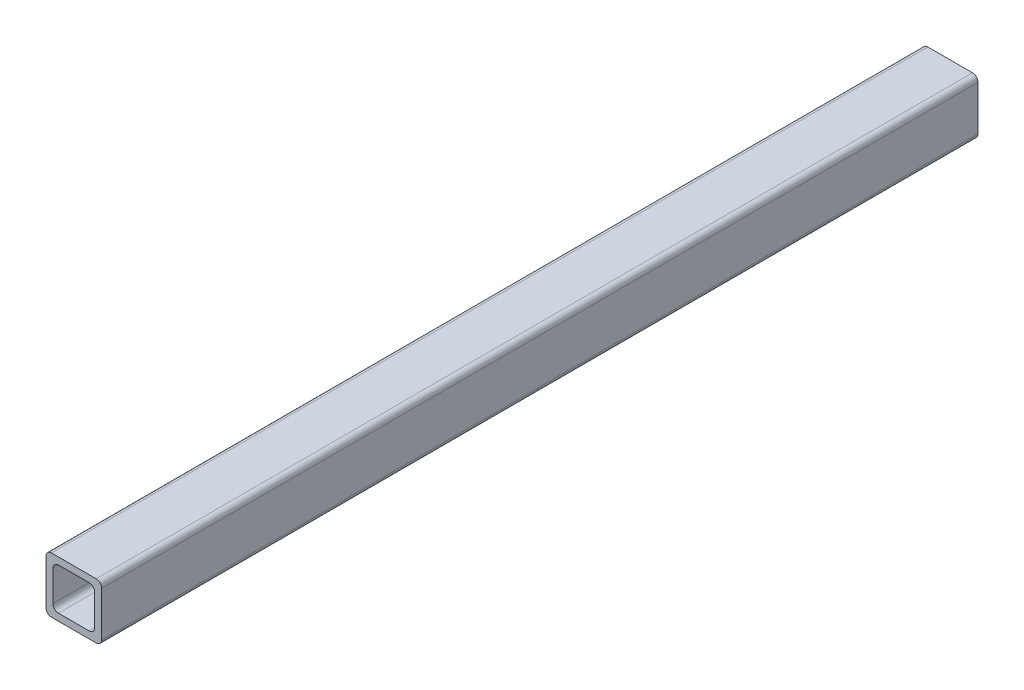
ISO-10303-21;
HEADER;
FILE_DESCRIPTION(('STEP AP214'),'2;1');
FILE_NAME('part.step','',(''),(''),'','','');
FILE_SCHEMA(('AUTOMOTIVE_DESIGN { 1 0 10303 214 1 1 1 1 }'));
ENDSEC;
DATA;
#1=APPLICATION_CONTEXT('core data for automotive mechanical design processes');
#2=APPLICATION_PROTOCOL_DEFINITION('international standard','automotive_design',2000,#1);
#3=PRODUCT_CONTEXT('',#1,'mechanical');
#4=PRODUCT('Part','Part','',(#3));
#5=PRODUCT_RELATED_PRODUCT_CATEGORY('part','',(#4));
#6=PRODUCT_DEFINITION_FORMATION('','',#4);
#7=PRODUCT_DEFINITION_CONTEXT('part definition',#1,'design');
#8=PRODUCT_DEFINITION('design','',#6,#7);
#9=PRODUCT_DEFINITION_SHAPE('','',#8);
#10=(LENGTH_UNIT() NAMED_UNIT(*) SI_UNIT(.MILLI.,.METRE.));
#11=(NAMED_UNIT(*) PLANE_ANGLE_UNIT() SI_UNIT($,.RADIAN.));
#12=(NAMED_UNIT(*) SI_UNIT($,.STERADIAN.) SOLID_ANGLE_UNIT());
#13=UNCERTAINTY_MEASURE_WITH_UNIT(LENGTH_MEASURE(1.E-05),#10,'distance_accuracy_value','');
#14=(GEOMETRIC_REPRESENTATION_CONTEXT(3) GLOBAL_UNCERTAINTY_ASSIGNED_CONTEXT((#13)) GLOBAL_UNIT_ASSIGNED_CONTEXT((#10,
#11,#12)) REPRESENTATION_CONTEXT('',''));
#15=CARTESIAN_POINT('',(0.,0.,0.));
#16=DIRECTION('',(0.,0.,1.));
#17=DIRECTION('',(1.,0.,0.));
#18=AXIS2_PLACEMENT_3D('',#15,#16,#17);
#19=CARTESIAN_POINT('',(10.2,-10.2,400.));
#20=DIRECTION('',(0.,0.,-1.));
#21=DIRECTION('',(-1.,0.,0.));
#22=AXIS2_PLACEMENT_3D('',#19,#20,#21);
#23=PLANE('',#22);
#24=CARTESIAN_POINT('',(10.2,-10.2,400.));
#25=DIRECTION('',(0.,0.,1.));
#26=DIRECTION('',(-1.,0.,0.));
#27=AXIS2_PLACEMENT_3D('',#24,#25,#26);
#28=CIRCLE('',#27,2.5);
#29=CARTESIAN_POINT('',(10.2,-12.7,400.));
#30=VERTEX_POINT('',#29);
#31=CARTESIAN_POINT('',(12.7,-10.2,400.));
#32=VERTEX_POINT('',#31);
#33=EDGE_CURVE('E242',#30,#32,#28,.T.);
#34=ORIENTED_EDGE('',*,*,#33,.T.);
#35=DIRECTION('',(0.,1.,0.));
#36=VECTOR('',#35,1.);
#37=CARTESIAN_POINT('',(12.7,-10.2,400.));
#38=LINE('',#37,#36);
#39=CARTESIAN_POINT('',(12.7,10.2,400.));
#40=VERTEX_POINT('',#39);
#41=EDGE_CURVE('E246',#32,#40,#38,.T.);
#42=ORIENTED_EDGE('',*,*,#41,.T.);
#43=CARTESIAN_POINT('',(10.2,10.2,400.));
#44=DIRECTION('',(0.,0.,1.));
#45=DIRECTION('',(1.,0.,0.));
#46=AXIS2_PLACEMENT_3D('',#43,#44,#45);
#47=CIRCLE('',#46,2.5);
#48=CARTESIAN_POINT('',(10.2,12.7,400.));
#49=VERTEX_POINT('',#48);
#50=EDGE_CURVE('E250',#40,#49,#47,.T.);
#51=ORIENTED_EDGE('',*,*,#50,.T.);
#52=DIRECTION('',(-1.,0.,0.));
#53=VECTOR('',#52,1.);
#54=CARTESIAN_POINT('',(-10.2,12.7,400.));
#55=LINE('',#54,#53);
#56=CARTESIAN_POINT('',(-10.2,12.7,400.));
#57=VERTEX_POINT('',#56);
#58=EDGE_CURVE('E253',#49,#57,#55,.T.);
#59=ORIENTED_EDGE('',*,*,#58,.T.);
#60=CARTESIAN_POINT('',(-10.2,10.2,400.));
#61=DIRECTION('',(0.,0.,1.));
#62=DIRECTION('',(1.,0.,0.));
#63=AXIS2_PLACEMENT_3D('',#60,#61,#62);
#64=CIRCLE('',#63,2.5);
#65=CARTESIAN_POINT('',(-12.7,10.2,400.));
#66=VERTEX_POINT('',#65);
#67=EDGE_CURVE('E256',#57,#66,#64,.T.);
#68=ORIENTED_EDGE('',*,*,#67,.T.);
#69=DIRECTION('',(0.,-1.,0.));
#70=VECTOR('',#69,1.);
#71=CARTESIAN_POINT('',(-12.7,-10.2,400.));
#72=LINE('',#71,#70);
#73=CARTESIAN_POINT('',(-12.7,-10.2,400.));
#74=VERTEX_POINT('',#73);
#75=EDGE_CURVE('E259',#66,#74,#72,.T.);
#76=ORIENTED_EDGE('',*,*,#75,.T.);
#77=CARTESIAN_POINT('',(-10.2,-10.2,400.));
#78=DIRECTION('',(0.,0.,1.));
#79=DIRECTION('',(-1.,0.,0.));
#80=AXIS2_PLACEMENT_3D('',#77,#78,#79);
#81=CIRCLE('',#80,2.5);
#82=CARTESIAN_POINT('',(-10.2,-12.7,400.));
#83=VERTEX_POINT('',#82);
#84=EDGE_CURVE('E262',#74,#83,#81,.T.);
#85=ORIENTED_EDGE('',*,*,#84,.T.);
#86=DIRECTION('',(1.,0.,0.));
#87=VECTOR('',#86,1.);
#88=CARTESIAN_POINT('',(-10.2,-12.7,400.));
#89=LINE('',#88,#87);
#90=EDGE_CURVE('E265',#83,#30,#89,.T.);
#91=ORIENTED_EDGE('',*,*,#90,.T.);
#92=EDGE_LOOP('',(#34,#42,#51,#59,#68,#76,#85,#91));
#93=FACE_BOUND('',#92,.T.);
#94=CARTESIAN_POINT('',(-7.02500000000001,-7.02499999999998,400.));
#95=DIRECTION('',(0.,0.,1.));
#96=DIRECTION('',(-1.,0.,0.));
#97=AXIS2_PLACEMENT_3D('',#94,#95,#96);
#98=CIRCLE('',#97,2.5);
#99=CARTESIAN_POINT('',(-9.52500000000001,-7.02499999999998,400.));
#100=VERTEX_POINT('',#99);
#101=CARTESIAN_POINT('',(-7.02500000000001,-9.52499999999998,400.));
#102=VERTEX_POINT('',#101);
#103=EDGE_CURVE('E153',#100,#102,#98,.T.);
#104=ORIENTED_EDGE('',*,*,#103,.F.);
#105=DIRECTION('',(0.,-1.,0.));
#106=VECTOR('',#105,1.);
#107=CARTESIAN_POINT('',(-9.52500000000001,-7.02499999999998,400.));
#108=LINE('',#107,#106);
#109=CARTESIAN_POINT('',(-9.52500000000001,7.025,400.));
#110=VERTEX_POINT('',#109);
#111=EDGE_CURVE('E194',#110,#100,#108,.T.);
#112=ORIENTED_EDGE('',*,*,#111,.F.);
#113=CARTESIAN_POINT('',(-7.025,7.025,400.));
#114=DIRECTION('',(0.,0.,1.));
#115=DIRECTION('',(-1.,0.,0.));
#116=AXIS2_PLACEMENT_3D('',#113,#114,#115);
#117=CIRCLE('',#116,2.5);
#118=CARTESIAN_POINT('',(-7.025,9.52500000000001,400.));
#119=VERTEX_POINT('',#118);
#120=EDGE_CURVE('E191',#119,#110,#117,.T.);
#121=ORIENTED_EDGE('',*,*,#120,.F.);
#122=DIRECTION('',(-1.,0.,0.));
#123=VECTOR('',#122,1.);
#124=CARTESIAN_POINT('',(-7.025,9.52500000000001,400.));
#125=LINE('',#124,#123);
#126=CARTESIAN_POINT('',(7.02499999999999,9.52500000000001,400.));
#127=VERTEX_POINT('',#126);
#128=EDGE_CURVE('E188',#127,#119,#125,.T.);
#129=ORIENTED_EDGE('',*,*,#128,.F.);
#130=CARTESIAN_POINT('',(7.02499999999999,7.025,400.));
#131=DIRECTION('',(0.,0.,1.));
#132=DIRECTION('',(1.,0.,0.));
#133=AXIS2_PLACEMENT_3D('',#130,#131,#132);
#134=CIRCLE('',#133,2.5);
#135=CARTESIAN_POINT('',(9.52499999999999,7.025,400.));
#136=VERTEX_POINT('',#135);
#137=EDGE_CURVE('E185',#136,#127,#134,.T.);
#138=ORIENTED_EDGE('',*,*,#137,.F.);
#139=DIRECTION('',(0.,1.,0.));
#140=VECTOR('',#139,1.);
#141=CARTESIAN_POINT('',(9.52499999999999,-7.02499999999998,400.));
#142=LINE('',#141,#140);
#143=CARTESIAN_POINT('',(9.52499999999999,-7.02499999999998,400.));
#144=VERTEX_POINT('',#143);
#145=EDGE_CURVE('E180',#144,#136,#142,.T.);
#146=ORIENTED_EDGE('',*,*,#145,.F.);
#147=CARTESIAN_POINT('',(7.02499999999999,-7.02499999999998,400.));
#148=DIRECTION('',(0.,0.,1.));
#149=DIRECTION('',(1.,0.,0.));
#150=AXIS2_PLACEMENT_3D('',#147,#148,#149);
#151=CIRCLE('',#150,2.5);
#152=CARTESIAN_POINT('',(7.02499999999999,-9.52499999999998,400.));
#153=VERTEX_POINT('',#152);
#154=EDGE_CURVE('E176',#153,#144,#151,.T.);
#155=ORIENTED_EDGE('',*,*,#154,.F.);
#156=DIRECTION('',(1.,0.,0.));
#157=VECTOR('',#156,1.);
#158=CARTESIAN_POINT('',(-7.02500000000001,-9.52499999999998,400.));
#159=LINE('',#158,#157);
#160=EDGE_CURVE('E162',#102,#153,#159,.T.);
#161=ORIENTED_EDGE('',*,*,#160,.F.);
#162=EDGE_LOOP('',(#104,#112,#121,#129,#138,#146,#155,#161));
#163=FACE_BOUND('',#162,.T.);
#164=ADVANCED_FACE('F39',(#93,#163),#23,.F.);
#165=CARTESIAN_POINT('',(10.2,-10.2,0.));
#166=DIRECTION('',(0.,0.,-1.));
#167=DIRECTION('',(-1.,0.,0.));
#168=AXIS2_PLACEMENT_3D('',#165,#166,#167);
#169=PLANE('',#168);
#170=CARTESIAN_POINT('',(10.2,-10.2,0.));
#171=DIRECTION('',(0.,0.,1.));
#172=DIRECTION('',(-1.,0.,0.));
#173=AXIS2_PLACEMENT_3D('',#170,#171,#172);
#174=CIRCLE('',#173,2.5);
#175=CARTESIAN_POINT('',(10.2,-12.7,0.));
#176=VERTEX_POINT('',#175);
#177=CARTESIAN_POINT('',(12.7,-10.2,0.));
#178=VERTEX_POINT('',#177);
#179=EDGE_CURVE('E171',#176,#178,#174,.T.);
#180=ORIENTED_EDGE('',*,*,#179,.F.);
#181=DIRECTION('',(1.,0.,0.));
#182=VECTOR('',#181,1.);
#183=CARTESIAN_POINT('',(-10.2,-12.7,0.));
#184=LINE('',#183,#182);
#185=CARTESIAN_POINT('',(-10.2,-12.7,0.));
#186=VERTEX_POINT('',#185);
#187=EDGE_CURVE('E247',#186,#176,#184,.T.);
#188=ORIENTED_EDGE('',*,*,#187,.F.);
#189=CARTESIAN_POINT('',(-10.2,-10.2,0.));
#190=DIRECTION('',(0.,0.,1.));
#191=DIRECTION('',(-1.,0.,0.));
#192=AXIS2_PLACEMENT_3D('',#189,#190,#191);
#193=CIRCLE('',#192,2.5);
#194=CARTESIAN_POINT('',(-12.7,-10.2,0.));
#195=VERTEX_POINT('',#194);
#196=EDGE_CURVE('E287',#195,#186,#193,.T.);
#197=ORIENTED_EDGE('',*,*,#196,.F.);
#198=DIRECTION('',(0.,-1.,0.));
#199=VECTOR('',#198,1.);
#200=CARTESIAN_POINT('',(-12.7,-10.2,0.));
#201=LINE('',#200,#199);
#202=CARTESIAN_POINT('',(-12.7,10.2,0.));
#203=VERTEX_POINT('',#202);
#204=EDGE_CURVE('E284',#203,#195,#201,.T.);
#205=ORIENTED_EDGE('',*,*,#204,.F.);
#206=CARTESIAN_POINT('',(-10.2,10.2,0.));
#207=DIRECTION('',(0.,0.,1.));
#208=DIRECTION('',(1.,0.,0.));
#209=AXIS2_PLACEMENT_3D('',#206,#207,#208);
#210=CIRCLE('',#209,2.5);
#211=CARTESIAN_POINT('',(-10.2,12.7,0.));
#212=VERTEX_POINT('',#211);
#213=EDGE_CURVE('E281',#212,#203,#210,.T.);
#214=ORIENTED_EDGE('',*,*,#213,.F.);
#215=DIRECTION('',(-1.,0.,0.));
#216=VECTOR('',#215,1.);
#217=CARTESIAN_POINT('',(-10.2,12.7,0.));
#218=LINE('',#217,#216);
#219=CARTESIAN_POINT('',(10.2,12.7,0.));
#220=VERTEX_POINT('',#219);
#221=EDGE_CURVE('E278',#220,#212,#218,.T.);
#222=ORIENTED_EDGE('',*,*,#221,.F.);
#223=CARTESIAN_POINT('',(10.2,10.2,0.));
#224=DIRECTION('',(0.,0.,1.));
#225=DIRECTION('',(1.,0.,0.));
#226=AXIS2_PLACEMENT_3D('',#223,#224,#225);
#227=CIRCLE('',#226,2.5);
#228=CARTESIAN_POINT('',(12.7,10.2,0.));
#229=VERTEX_POINT('',#228);
#230=EDGE_CURVE('E275',#229,#220,#227,.T.);
#231=ORIENTED_EDGE('',*,*,#230,.F.);
#232=DIRECTION('',(0.,1.,0.));
#233=VECTOR('',#232,1.);
#234=CARTESIAN_POINT('',(12.7,-10.2,0.));
#235=LINE('',#234,#233);
#236=EDGE_CURVE('E272',#178,#229,#235,.T.);
#237=ORIENTED_EDGE('',*,*,#236,.F.);
#238=EDGE_LOOP('',(#180,#188,#197,#205,#214,#222,#231,#237));
#239=FACE_BOUND('',#238,.T.);
#240=DIRECTION('',(0.,-1.,0.));
#241=VECTOR('',#240,1.);
#242=CARTESIAN_POINT('',(-9.52500000000001,-7.02499999999998,0.));
#243=LINE('',#242,#241);
#244=CARTESIAN_POINT('',(-9.52500000000001,7.02500000000001,0.));
#245=VERTEX_POINT('',#244);
#246=CARTESIAN_POINT('',(-9.52500000000001,-7.02499999999998,0.));
#247=VERTEX_POINT('',#246);
#248=EDGE_CURVE('E163',#245,#247,#243,.T.);
#249=ORIENTED_EDGE('',*,*,#248,.T.);
#250=CARTESIAN_POINT('',(-7.02500000000001,-7.02499999999998,0.));
#251=DIRECTION('',(0.,0.,1.));
#252=DIRECTION('',(-1.,0.,0.));
#253=AXIS2_PLACEMENT_3D('',#250,#251,#252);
#254=CIRCLE('',#253,2.5);
#255=CARTESIAN_POINT('',(-7.02500000000001,-9.52499999999998,0.));
#256=VERTEX_POINT('',#255);
#257=EDGE_CURVE('E63',#247,#256,#254,.T.);
#258=ORIENTED_EDGE('',*,*,#257,.T.);
#259=DIRECTION('',(1.,0.,0.));
#260=VECTOR('',#259,1.);
#261=CARTESIAN_POINT('',(-7.02500000000001,-9.52499999999998,0.));
#262=LINE('',#261,#260);
#263=CARTESIAN_POINT('',(7.02499999999999,-9.52499999999998,0.));
#264=VERTEX_POINT('',#263);
#265=EDGE_CURVE('E169',#256,#264,#262,.T.);
#266=ORIENTED_EDGE('',*,*,#265,.T.);
#267=CARTESIAN_POINT('',(7.02499999999999,-7.02499999999998,0.));
#268=DIRECTION('',(0.,0.,1.));
#269=DIRECTION('',(1.,0.,0.));
#270=AXIS2_PLACEMENT_3D('',#267,#268,#269);
#271=CIRCLE('',#270,2.5);
#272=CARTESIAN_POINT('',(9.52499999999999,-7.02499999999998,0.));
#273=VERTEX_POINT('',#272);
#274=EDGE_CURVE('E201',#264,#273,#271,.T.);
#275=ORIENTED_EDGE('',*,*,#274,.T.);
#276=DIRECTION('',(0.,1.,0.));
#277=VECTOR('',#276,1.);
#278=CARTESIAN_POINT('',(9.52499999999999,-7.02499999999998,0.));
#279=LINE('',#278,#277);
#280=CARTESIAN_POINT('',(9.52499999999999,7.025,0.));
#281=VERTEX_POINT('',#280);
#282=EDGE_CURVE('E205',#273,#281,#279,.T.);
#283=ORIENTED_EDGE('',*,*,#282,.T.);
#284=CARTESIAN_POINT('',(7.02499999999999,7.025,0.));
#285=DIRECTION('',(0.,0.,1.));
#286=DIRECTION('',(1.,0.,0.));
#287=AXIS2_PLACEMENT_3D('',#284,#285,#286);
#288=CIRCLE('',#287,2.5);
#289=CARTESIAN_POINT('',(7.02499999999999,9.52500000000001,0.));
#290=VERTEX_POINT('',#289);
#291=EDGE_CURVE('E209',#281,#290,#288,.T.);
#292=ORIENTED_EDGE('',*,*,#291,.T.);
#293=DIRECTION('',(-1.,0.,0.));
#294=VECTOR('',#293,1.);
#295=CARTESIAN_POINT('',(-7.025,9.52500000000001,0.));
#296=LINE('',#295,#294);
#297=CARTESIAN_POINT('',(-7.025,9.52500000000001,0.));
#298=VERTEX_POINT('',#297);
#299=EDGE_CURVE('E213',#290,#298,#296,.T.);
#300=ORIENTED_EDGE('',*,*,#299,.T.);
#301=CARTESIAN_POINT('',(-7.025,7.025,0.));
#302=DIRECTION('',(0.,0.,1.));
#303=DIRECTION('',(-1.,0.,0.));
#304=AXIS2_PLACEMENT_3D('',#301,#302,#303);
#305=CIRCLE('',#304,2.5);
#306=EDGE_CURVE('E217',#298,#245,#305,.T.);
#307=ORIENTED_EDGE('',*,*,#306,.T.);
#308=EDGE_LOOP('',(#249,#258,#266,#275,#283,#292,#300,#307));
#309=FACE_BOUND('',#308,.T.);
#310=ADVANCED_FACE('F326',(#239,#309),#169,.T.);
#311=CARTESIAN_POINT('',(10.2,-10.2,400.));
#312=DIRECTION('',(0.,0.,-1.));
#313=DIRECTION('',(-1.,0.,0.));
#314=AXIS2_PLACEMENT_3D('',#311,#312,#313);
#315=CYLINDRICAL_SURFACE('',#314,2.5);
#316=ORIENTED_EDGE('',*,*,#179,.T.);
#317=DIRECTION('',(0.,0.,-1.));
#318=VECTOR('',#317,1.);
#319=CARTESIAN_POINT('',(12.7,-10.2,400.));
#320=LINE('',#319,#318);
#321=EDGE_CURVE('E11',#32,#178,#320,.T.);
#322=ORIENTED_EDGE('',*,*,#321,.F.);
#323=ORIENTED_EDGE('',*,*,#33,.F.);
#324=DIRECTION('',(0.,0.,-1.));
#325=VECTOR('',#324,1.);
#326=CARTESIAN_POINT('',(10.2,-12.7,400.));
#327=LINE('',#326,#325);
#328=EDGE_CURVE('E268',#30,#176,#327,.T.);
#329=ORIENTED_EDGE('',*,*,#328,.T.);
#330=EDGE_LOOP('',(#316,#322,#323,#329));
#331=FACE_BOUND('',#330,.T.);
#332=ADVANCED_FACE('F41',(#331),#315,.T.);
#333=CARTESIAN_POINT('',(12.7,-10.2,400.));
#334=DIRECTION('',(-1.,0.,0.));
#335=DIRECTION('',(0.,-1.,0.));
#336=AXIS2_PLACEMENT_3D('',#333,#334,#335);
#337=PLANE('',#336);
#338=ORIENTED_EDGE('',*,*,#236,.T.);
#339=DIRECTION('',(0.,0.,-1.));
#340=VECTOR('',#339,1.);
#341=CARTESIAN_POINT('',(12.7,10.2,400.));
#342=LINE('',#341,#340);
#343=EDGE_CURVE('E48',#40,#229,#342,.T.);
#344=ORIENTED_EDGE('',*,*,#343,.F.);
#345=ORIENTED_EDGE('',*,*,#41,.F.);
#346=ORIENTED_EDGE('',*,*,#321,.T.);
#347=EDGE_LOOP('',(#338,#344,#345,#346));
#348=FACE_BOUND('',#347,.T.);
#349=ADVANCED_FACE('F343',(#348),#337,.F.);
#350=CARTESIAN_POINT('',(10.2,10.2,400.));
#351=DIRECTION('',(0.,0.,-1.));
#352=DIRECTION('',(-1.,0.,0.));
#353=AXIS2_PLACEMENT_3D('',#350,#351,#352);
#354=CYLINDRICAL_SURFACE('',#353,2.5);
#355=ORIENTED_EDGE('',*,*,#230,.T.);
#356=DIRECTION('',(0.,0.,-1.));
#357=VECTOR('',#356,1.);
#358=CARTESIAN_POINT('',(10.2,12.7,400.));
#359=LINE('',#358,#357);
#360=EDGE_CURVE('E311',#49,#220,#359,.T.);
#361=ORIENTED_EDGE('',*,*,#360,.F.);
#362=ORIENTED_EDGE('',*,*,#50,.F.);
#363=ORIENTED_EDGE('',*,*,#343,.T.);
#364=EDGE_LOOP('',(#355,#361,#362,#363));
#365=FACE_BOUND('',#364,.T.);
#366=ADVANCED_FACE('F320',(#365),#354,.T.);
#367=CARTESIAN_POINT('',(-10.2,12.7,400.));
#368=DIRECTION('',(0.,-1.,0.));
#369=DIRECTION('',(1.,0.,0.));
#370=AXIS2_PLACEMENT_3D('',#367,#368,#369);
#371=PLANE('',#370);
#372=ORIENTED_EDGE('',*,*,#221,.T.);
#373=DIRECTION('',(0.,0.,-1.));
#374=VECTOR('',#373,1.);
#375=CARTESIAN_POINT('',(-10.2,12.7,400.));
#376=LINE('',#375,#374);
#377=EDGE_CURVE('E307',#57,#212,#376,.T.);
#378=ORIENTED_EDGE('',*,*,#377,.F.);
#379=ORIENTED_EDGE('',*,*,#58,.F.);
#380=ORIENTED_EDGE('',*,*,#360,.T.);
#381=EDGE_LOOP('',(#372,#378,#379,#380));
#382=FACE_BOUND('',#381,.T.);
#383=ADVANCED_FACE('F332',(#382),#371,.F.);
#384=CARTESIAN_POINT('',(-10.2,10.2,400.));
#385=DIRECTION('',(0.,0.,-1.));
#386=DIRECTION('',(-1.,0.,0.));
#387=AXIS2_PLACEMENT_3D('',#384,#385,#386);
#388=CYLINDRICAL_SURFACE('',#387,2.5);
#389=ORIENTED_EDGE('',*,*,#213,.T.);
#390=DIRECTION('',(0.,0.,-1.));
#391=VECTOR('',#390,1.);
#392=CARTESIAN_POINT('',(-12.7,10.2,400.));
#393=LINE('',#392,#391);
#394=EDGE_CURVE('E303',#66,#203,#393,.T.);
#395=ORIENTED_EDGE('',*,*,#394,.F.);
#396=ORIENTED_EDGE('',*,*,#67,.F.);
#397=ORIENTED_EDGE('',*,*,#377,.T.);
#398=EDGE_LOOP('',(#389,#395,#396,#397));
#399=FACE_BOUND('',#398,.T.);
#400=ADVANCED_FACE('F336',(#399),#388,.T.);
#401=CARTESIAN_POINT('',(-12.7,-10.2,400.));
#402=DIRECTION('',(1.,0.,0.));
#403=DIRECTION('',(0.,0.,-1.));
#404=AXIS2_PLACEMENT_3D('',#401,#402,#403);
#405=PLANE('',#404);
#406=ORIENTED_EDGE('',*,*,#204,.T.);
#407=DIRECTION('',(0.,0.,-1.));
#408=VECTOR('',#407,1.);
#409=CARTESIAN_POINT('',(-12.7,-10.2,400.));
#410=LINE('',#409,#408);
#411=EDGE_CURVE('E299',#74,#195,#410,.T.);
#412=ORIENTED_EDGE('',*,*,#411,.F.);
#413=ORIENTED_EDGE('',*,*,#75,.F.);
#414=ORIENTED_EDGE('',*,*,#394,.T.);
#415=EDGE_LOOP('',(#406,#412,#413,#414));
#416=FACE_BOUND('',#415,.T.);
#417=ADVANCED_FACE('F356',(#416),#405,.F.);
#418=CARTESIAN_POINT('',(-10.2,-10.2,400.));
#419=DIRECTION('',(0.,0.,-1.));
#420=DIRECTION('',(-1.,0.,0.));
#421=AXIS2_PLACEMENT_3D('',#418,#419,#420);
#422=CYLINDRICAL_SURFACE('',#421,2.5);
#423=ORIENTED_EDGE('',*,*,#196,.T.);
#424=DIRECTION('',(0.,0.,-1.));
#425=VECTOR('',#424,1.);
#426=CARTESIAN_POINT('',(-10.2,-12.7,400.));
#427=LINE('',#426,#425);
#428=EDGE_CURVE('E295',#83,#186,#427,.T.);
#429=ORIENTED_EDGE('',*,*,#428,.F.);
#430=ORIENTED_EDGE('',*,*,#84,.F.);
#431=ORIENTED_EDGE('',*,*,#411,.T.);
#432=EDGE_LOOP('',(#423,#429,#430,#431));
#433=FACE_BOUND('',#432,.T.);
#434=ADVANCED_FACE('F354',(#433),#422,.T.);
#435=CARTESIAN_POINT('',(-10.2,-12.7,400.));
#436=DIRECTION('',(0.,1.,0.));
#437=DIRECTION('',(0.,0.,1.));
#438=AXIS2_PLACEMENT_3D('',#435,#436,#437);
#439=PLANE('',#438);
#440=ORIENTED_EDGE('',*,*,#187,.T.);
#441=ORIENTED_EDGE('',*,*,#328,.F.);
#442=ORIENTED_EDGE('',*,*,#90,.F.);
#443=ORIENTED_EDGE('',*,*,#428,.T.);
#444=EDGE_LOOP('',(#440,#441,#442,#443));
#445=FACE_BOUND('',#444,.T.);
#446=ADVANCED_FACE('F349',(#445),#439,.F.);
#447=CARTESIAN_POINT('',(-7.02500000000001,-7.02499999999998,400.));
#448=DIRECTION('',(0.,0.,-1.));
#449=DIRECTION('',(-1.,0.,0.));
#450=AXIS2_PLACEMENT_3D('',#447,#448,#449);
#451=CYLINDRICAL_SURFACE('',#450,2.5);
#452=ORIENTED_EDGE('',*,*,#257,.F.);
#453=DIRECTION('',(0.,0.,-1.));
#454=VECTOR('',#453,1.);
#455=CARTESIAN_POINT('',(-9.52500000000001,-7.02499999999998,400.));
#456=LINE('',#455,#454);
#457=EDGE_CURVE('E157',#100,#247,#456,.T.);
#458=ORIENTED_EDGE('',*,*,#457,.F.);
#459=ORIENTED_EDGE('',*,*,#103,.T.);
#460=DIRECTION('',(0.,0.,-1.));
#461=VECTOR('',#460,1.);
#462=CARTESIAN_POINT('',(-7.02500000000001,-9.52499999999998,400.));
#463=LINE('',#462,#461);
#464=EDGE_CURVE('E156',#102,#256,#463,.T.);
#465=ORIENTED_EDGE('',*,*,#464,.T.);
#466=EDGE_LOOP('',(#452,#458,#459,#465));
#467=FACE_BOUND('',#466,.T.);
#468=ADVANCED_FACE('F155',(#467),#451,.F.);
#469=CARTESIAN_POINT('',(-7.02500000000001,-9.52499999999998,400.));
#470=DIRECTION('',(0.,1.,0.));
#471=DIRECTION('',(0.,0.,1.));
#472=AXIS2_PLACEMENT_3D('',#469,#470,#471);
#473=PLANE('',#472);
#474=ORIENTED_EDGE('',*,*,#265,.F.);
#475=ORIENTED_EDGE('',*,*,#464,.F.);
#476=ORIENTED_EDGE('',*,*,#160,.T.);
#477=DIRECTION('',(0.,0.,-1.));
#478=VECTOR('',#477,1.);
#479=CARTESIAN_POINT('',(7.02499999999999,-9.52499999999998,400.));
#480=LINE('',#479,#478);
#481=EDGE_CURVE('E172',#153,#264,#480,.T.);
#482=ORIENTED_EDGE('',*,*,#481,.T.);
#483=EDGE_LOOP('',(#474,#475,#476,#482));
#484=FACE_BOUND('',#483,.T.);
#485=ADVANCED_FACE('F166',(#484),#473,.T.);
#486=CARTESIAN_POINT('',(7.02499999999999,-7.02499999999998,400.));
#487=DIRECTION('',(0.,0.,-1.));
#488=DIRECTION('',(-1.,0.,0.));
#489=AXIS2_PLACEMENT_3D('',#486,#487,#488);
#490=CYLINDRICAL_SURFACE('',#489,2.5);
#491=ORIENTED_EDGE('',*,*,#274,.F.);
#492=ORIENTED_EDGE('',*,*,#481,.F.);
#493=ORIENTED_EDGE('',*,*,#154,.T.);
#494=DIRECTION('',(0.,0.,-1.));
#495=VECTOR('',#494,1.);
#496=CARTESIAN_POINT('',(9.52499999999999,-7.02499999999998,400.));
#497=LINE('',#496,#495);
#498=EDGE_CURVE('E237',#144,#273,#497,.T.);
#499=ORIENTED_EDGE('',*,*,#498,.T.);
#500=EDGE_LOOP('',(#491,#492,#493,#499));
#501=FACE_BOUND('',#500,.T.);
#502=ADVANCED_FACE('F381',(#501),#490,.F.);
#503=CARTESIAN_POINT('',(9.52499999999999,-7.02499999999998,400.));
#504=DIRECTION('',(-1.,0.,0.));
#505=DIRECTION('',(0.,-1.,0.));
#506=AXIS2_PLACEMENT_3D('',#503,#504,#505);
#507=PLANE('',#506);
#508=ORIENTED_EDGE('',*,*,#282,.F.);
#509=ORIENTED_EDGE('',*,*,#498,.F.);
#510=ORIENTED_EDGE('',*,*,#145,.T.);
#511=DIRECTION('',(0.,0.,-1.));
#512=VECTOR('',#511,1.);
#513=CARTESIAN_POINT('',(9.52499999999999,7.025,400.));
#514=LINE('',#513,#512);
#515=EDGE_CURVE('E234',#136,#281,#514,.T.);
#516=ORIENTED_EDGE('',*,*,#515,.T.);
#517=EDGE_LOOP('',(#508,#509,#510,#516));
#518=FACE_BOUND('',#517,.T.);
#519=ADVANCED_FACE('F385',(#518),#507,.T.);
#520=CARTESIAN_POINT('',(7.02499999999999,7.025,400.));
#521=DIRECTION('',(0.,0.,-1.));
#522=DIRECTION('',(-1.,0.,0.));
#523=AXIS2_PLACEMENT_3D('',#520,#521,#522);
#524=CYLINDRICAL_SURFACE('',#523,2.5);
#525=ORIENTED_EDGE('',*,*,#291,.F.);
#526=ORIENTED_EDGE('',*,*,#515,.F.);
#527=ORIENTED_EDGE('',*,*,#137,.T.);
#528=DIRECTION('',(0.,0.,-1.));
#529=VECTOR('',#528,1.);
#530=CARTESIAN_POINT('',(7.02499999999999,9.52500000000001,400.));
#531=LINE('',#530,#529);
#532=EDGE_CURVE('E231',#127,#290,#531,.T.);
#533=ORIENTED_EDGE('',*,*,#532,.T.);
#534=EDGE_LOOP('',(#525,#526,#527,#533));
#535=FACE_BOUND('',#534,.T.);
#536=ADVANCED_FACE('F391',(#535),#524,.F.);
#537=CARTESIAN_POINT('',(-7.025,9.52500000000001,400.));
#538=DIRECTION('',(0.,-1.,0.));
#539=DIRECTION('',(0.,0.,-1.));
#540=AXIS2_PLACEMENT_3D('',#537,#538,#539);
#541=PLANE('',#540);
#542=ORIENTED_EDGE('',*,*,#299,.F.);
#543=ORIENTED_EDGE('',*,*,#532,.F.);
#544=ORIENTED_EDGE('',*,*,#128,.T.);
#545=DIRECTION('',(0.,0.,-1.));
#546=VECTOR('',#545,1.);
#547=CARTESIAN_POINT('',(-7.025,9.52500000000001,400.));
#548=LINE('',#547,#546);
#549=EDGE_CURVE('E228',#119,#298,#548,.T.);
#550=ORIENTED_EDGE('',*,*,#549,.T.);
#551=EDGE_LOOP('',(#542,#543,#544,#550));
#552=FACE_BOUND('',#551,.T.);
#553=ADVANCED_FACE('F395',(#552),#541,.T.);
#554=CARTESIAN_POINT('',(-7.025,7.025,400.));
#555=DIRECTION('',(0.,0.,-1.));
#556=DIRECTION('',(-1.,0.,0.));
#557=AXIS2_PLACEMENT_3D('',#554,#555,#556);
#558=CYLINDRICAL_SURFACE('',#557,2.5);
#559=ORIENTED_EDGE('',*,*,#306,.F.);
#560=ORIENTED_EDGE('',*,*,#549,.F.);
#561=ORIENTED_EDGE('',*,*,#120,.T.);
#562=DIRECTION('',(0.,0.,-1.));
#563=VECTOR('',#562,1.);
#564=CARTESIAN_POINT('',(-9.52500000000001,7.02500000000001,400.));
#565=LINE('',#564,#563);
#566=EDGE_CURVE('E55',#110,#245,#565,.T.);
#567=ORIENTED_EDGE('',*,*,#566,.T.);
#568=EDGE_LOOP('',(#559,#560,#561,#567));
#569=FACE_BOUND('',#568,.T.);
#570=ADVANCED_FACE('F399',(#569),#558,.F.);
#571=CARTESIAN_POINT('',(-9.52500000000001,-7.02499999999998,400.));
#572=DIRECTION('',(1.,0.,0.));
#573=DIRECTION('',(0.,0.,-1.));
#574=AXIS2_PLACEMENT_3D('',#571,#572,#573);
#575=PLANE('',#574);
#576=ORIENTED_EDGE('',*,*,#248,.F.);
#577=ORIENTED_EDGE('',*,*,#566,.F.);
#578=ORIENTED_EDGE('',*,*,#111,.T.);
#579=ORIENTED_EDGE('',*,*,#457,.T.);
#580=EDGE_LOOP('',(#576,#577,#578,#579));
#581=FACE_BOUND('',#580,.T.);
#582=ADVANCED_FACE('F403',(#581),#575,.T.);
#583=CLOSED_SHELL('',(#164,#310,#332,#349,#366,#383,#400,#417,#434,#446,#468,#485,#502,#519,
#536,#553,#570,#582));
#584=MANIFOLD_SOLID_BREP('B2',#583);
#585=ADVANCED_BREP_SHAPE_REPRESENTATION('',(#18,#584),#14);
#586=SHAPE_DEFINITION_REPRESENTATION(#9,#585);
ENDSEC;
END-ISO-10303-21;
